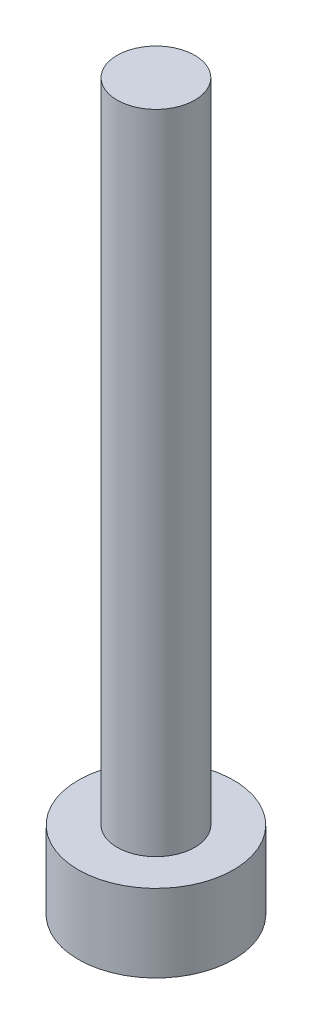
ISO-10303-21;
HEADER;
FILE_DESCRIPTION(('STEP AP214'),'2;1');
FILE_NAME('part.step','',(''),(''),'','','');
FILE_SCHEMA(('AUTOMOTIVE_DESIGN { 1 0 10303 214 1 1 1 1 }'));
ENDSEC;
DATA;
#1=APPLICATION_CONTEXT('core data for automotive mechanical design processes');
#2=APPLICATION_PROTOCOL_DEFINITION('international standard','automotive_design',2000,#1);
#3=PRODUCT_CONTEXT('',#1,'mechanical');
#4=PRODUCT('Part','Part','',(#3));
#5=PRODUCT_RELATED_PRODUCT_CATEGORY('part','',(#4));
#6=PRODUCT_DEFINITION_FORMATION('','',#4);
#7=PRODUCT_DEFINITION_CONTEXT('part definition',#1,'design');
#8=PRODUCT_DEFINITION('design','',#6,#7);
#9=PRODUCT_DEFINITION_SHAPE('','',#8);
#10=(LENGTH_UNIT() NAMED_UNIT(*) SI_UNIT(.MILLI.,.METRE.));
#11=(NAMED_UNIT(*) PLANE_ANGLE_UNIT() SI_UNIT($,.RADIAN.));
#12=(NAMED_UNIT(*) SI_UNIT($,.STERADIAN.) SOLID_ANGLE_UNIT());
#13=UNCERTAINTY_MEASURE_WITH_UNIT(LENGTH_MEASURE(1.E-05),#10,'distance_accuracy_value','');
#14=(GEOMETRIC_REPRESENTATION_CONTEXT(3) GLOBAL_UNCERTAINTY_ASSIGNED_CONTEXT((#13)) GLOBAL_UNIT_ASSIGNED_CONTEXT((#10,
#11,#12)) REPRESENTATION_CONTEXT('',''));
#15=CARTESIAN_POINT('',(0.,0.,0.));
#16=DIRECTION('',(0.,0.,1.));
#17=DIRECTION('',(1.,0.,0.));
#18=AXIS2_PLACEMENT_3D('',#15,#16,#17);
#19=CARTESIAN_POINT('',(0.,3.,0.));
#20=DIRECTION('',(0.,-1.,0.));
#21=DIRECTION('',(0.,0.,-1.));
#22=AXIS2_PLACEMENT_3D('',#19,#20,#21);
#23=CYLINDRICAL_SURFACE('',#22,3.);
#24=CARTESIAN_POINT('',(0.,3.,0.));
#25=DIRECTION('',(0.,1.,0.));
#26=DIRECTION('',(0.,0.,1.));
#27=AXIS2_PLACEMENT_3D('',#24,#25,#26);
#28=CIRCLE('',#27,3.);
#29=CARTESIAN_POINT('',(0.,3.,3.));
#30=VERTEX_POINT('',#29);
#31=EDGE_CURVE('E38',#30,#30,#28,.T.);
#32=ORIENTED_EDGE('',*,*,#31,.F.);
#33=EDGE_LOOP('',(#32));
#34=FACE_BOUND('',#33,.T.);
#35=CARTESIAN_POINT('',(0.,0.,0.));
#36=DIRECTION('',(0.,1.,0.));
#37=DIRECTION('',(0.,0.,1.));
#38=AXIS2_PLACEMENT_3D('',#35,#36,#37);
#39=CIRCLE('',#38,3.);
#40=CARTESIAN_POINT('',(0.,0.,3.));
#41=VERTEX_POINT('',#40);
#42=EDGE_CURVE('E34',#41,#41,#39,.T.);
#43=ORIENTED_EDGE('',*,*,#42,.T.);
#44=EDGE_LOOP('',(#43));
#45=FACE_BOUND('',#44,.T.);
#46=ADVANCED_FACE('F31',(#34,#45),#23,.T.);
#47=CARTESIAN_POINT('',(0.,3.,0.));
#48=DIRECTION('',(0.,1.,0.));
#49=DIRECTION('',(0.,0.,1.));
#50=AXIS2_PLACEMENT_3D('',#47,#48,#49);
#51=PLANE('',#50);
#52=CARTESIAN_POINT('',(0.,3.,0.));
#53=DIRECTION('',(0.,1.,0.));
#54=DIRECTION('',(0.,0.,1.));
#55=AXIS2_PLACEMENT_3D('',#52,#53,#54);
#56=CIRCLE('',#55,1.5);
#57=CARTESIAN_POINT('',(0.,3.,1.5));
#58=VERTEX_POINT('',#57);
#59=EDGE_CURVE('E10',#58,#58,#56,.T.);
#60=ORIENTED_EDGE('',*,*,#59,.F.);
#61=EDGE_LOOP('',(#60));
#62=FACE_BOUND('',#61,.T.);
#63=ORIENTED_EDGE('',*,*,#31,.T.);
#64=EDGE_LOOP('',(#63));
#65=FACE_BOUND('',#64,.T.);
#66=ADVANCED_FACE('F55',(#62,#65),#51,.T.);
#67=CARTESIAN_POINT('',(0.,0.,0.));
#68=DIRECTION('',(0.,1.,0.));
#69=DIRECTION('',(0.,0.,1.));
#70=AXIS2_PLACEMENT_3D('',#67,#68,#69);
#71=PLANE('',#70);
#72=ORIENTED_EDGE('',*,*,#42,.F.);
#73=EDGE_LOOP('',(#72));
#74=FACE_BOUND('',#73,.T.);
#75=ADVANCED_FACE('F52',(#74),#71,.F.);
#76=CARTESIAN_POINT('',(0.,28.,0.));
#77=DIRECTION('',(0.,-1.,0.));
#78=DIRECTION('',(0.,0.,-1.));
#79=AXIS2_PLACEMENT_3D('',#76,#77,#78);
#80=CYLINDRICAL_SURFACE('',#79,1.5);
#81=CARTESIAN_POINT('',(0.,28.,0.));
#82=DIRECTION('',(0.,1.,0.));
#83=DIRECTION('',(0.,0.,1.));
#84=AXIS2_PLACEMENT_3D('',#81,#82,#83);
#85=CIRCLE('',#84,1.5);
#86=CARTESIAN_POINT('',(0.,28.,1.5));
#87=VERTEX_POINT('',#86);
#88=EDGE_CURVE('E44',#87,#87,#85,.T.);
#89=ORIENTED_EDGE('',*,*,#88,.F.);
#90=EDGE_LOOP('',(#89));
#91=FACE_BOUND('',#90,.T.);
#92=ORIENTED_EDGE('',*,*,#59,.T.);
#93=EDGE_LOOP('',(#92));
#94=FACE_BOUND('',#93,.T.);
#95=ADVANCED_FACE('F54',(#91,#94),#80,.T.);
#96=CARTESIAN_POINT('',(0.,28.,0.));
#97=DIRECTION('',(0.,1.,0.));
#98=DIRECTION('',(0.,0.,1.));
#99=AXIS2_PLACEMENT_3D('',#96,#97,#98);
#100=PLANE('',#99);
#101=ORIENTED_EDGE('',*,*,#88,.T.);
#102=EDGE_LOOP('',(#101));
#103=FACE_BOUND('',#102,.T.);
#104=ADVANCED_FACE('F60',(#103),#100,.T.);
#105=CLOSED_SHELL('',(#46,#66,#75,#95,#104));
#106=MANIFOLD_SOLID_BREP('B2',#105);
#107=ADVANCED_BREP_SHAPE_REPRESENTATION('',(#18,#106),#14);
#108=SHAPE_DEFINITION_REPRESENTATION(#9,#107);
ENDSEC;
END-ISO-10303-21;
